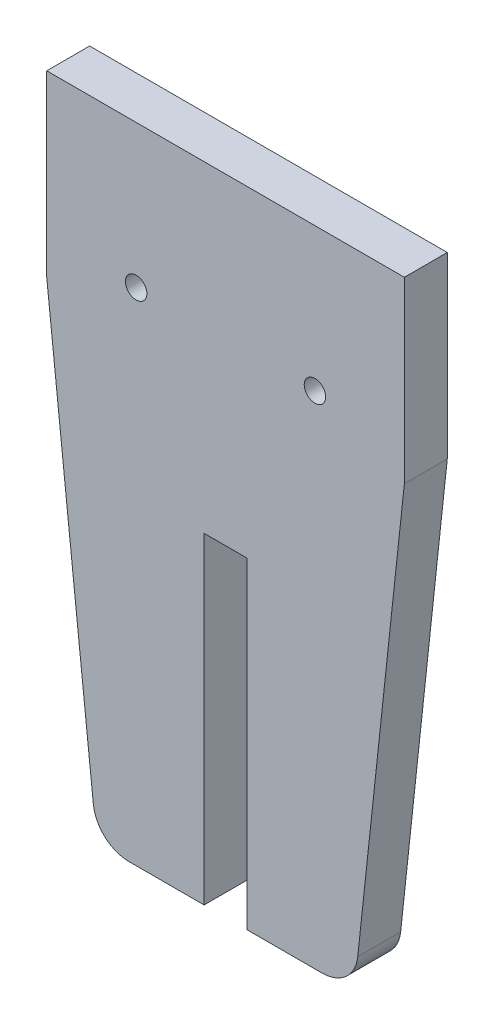
ISO-10303-21;
HEADER;
FILE_DESCRIPTION(('STEP AP214'),'2;1');
FILE_NAME('part.step','',(''),(''),'','','');
FILE_SCHEMA(('AUTOMOTIVE_DESIGN { 1 0 10303 214 1 1 1 1 }'));
ENDSEC;
DATA;
#1=APPLICATION_CONTEXT('core data for automotive mechanical design processes');
#2=APPLICATION_PROTOCOL_DEFINITION('international standard','automotive_design',2000,#1);
#3=PRODUCT_CONTEXT('',#1,'mechanical');
#4=PRODUCT('Part','Part','',(#3));
#5=PRODUCT_RELATED_PRODUCT_CATEGORY('part','',(#4));
#6=PRODUCT_DEFINITION_FORMATION('','',#4);
#7=PRODUCT_DEFINITION_CONTEXT('part definition',#1,'design');
#8=PRODUCT_DEFINITION('design','',#6,#7);
#9=PRODUCT_DEFINITION_SHAPE('','',#8);
#10=(LENGTH_UNIT() NAMED_UNIT(*) SI_UNIT(.MILLI.,.METRE.));
#11=(NAMED_UNIT(*) PLANE_ANGLE_UNIT() SI_UNIT($,.RADIAN.));
#12=(NAMED_UNIT(*) SI_UNIT($,.STERADIAN.) SOLID_ANGLE_UNIT());
#13=UNCERTAINTY_MEASURE_WITH_UNIT(LENGTH_MEASURE(1.E-05),#10,'distance_accuracy_value','');
#14=(GEOMETRIC_REPRESENTATION_CONTEXT(3) GLOBAL_UNCERTAINTY_ASSIGNED_CONTEXT((#13)) GLOBAL_UNIT_ASSIGNED_CONTEXT((#10,
#11,#12)) REPRESENTATION_CONTEXT('',''));
#15=CARTESIAN_POINT('',(0.,0.,0.));
#16=DIRECTION('',(0.,0.,1.));
#17=DIRECTION('',(1.,0.,0.));
#18=AXIS2_PLACEMENT_3D('',#15,#16,#17);
#19=CARTESIAN_POINT('',(18.,-90.,6.));
#20=DIRECTION('',(0.,1.,0.));
#21=DIRECTION('',(0.,0.,1.));
#22=AXIS2_PLACEMENT_3D('',#19,#20,#21);
#23=PLANE('',#22);
#24=DIRECTION('',(1.,0.,0.));
#25=VECTOR('',#24,1.);
#26=CARTESIAN_POINT('',(18.,-90.,0.));
#27=LINE('',#26,#25);
#28=CARTESIAN_POINT('',(3.,-90.,0.));
#29=VERTEX_POINT('',#28);
#30=CARTESIAN_POINT('',(13.5095510373289,-90.,0.));
#31=VERTEX_POINT('',#30);
#32=EDGE_CURVE('E148',#29,#31,#27,.T.);
#33=ORIENTED_EDGE('',*,*,#32,.T.);
#34=DIRECTION('',(0.,0.,-1.));
#35=VECTOR('',#34,1.);
#36=CARTESIAN_POINT('',(13.5095510373289,-90.,6.));
#37=LINE('',#36,#35);
#38=CARTESIAN_POINT('',(13.5095510373289,-90.,6.));
#39=VERTEX_POINT('',#38);
#40=EDGE_CURVE('E11',#31,#39,#37,.F.);
#41=ORIENTED_EDGE('',*,*,#40,.T.);
#42=DIRECTION('',(1.,0.,0.));
#43=VECTOR('',#42,1.);
#44=CARTESIAN_POINT('',(18.,-90.,6.));
#45=LINE('',#44,#43);
#46=CARTESIAN_POINT('',(3.,-90.,6.));
#47=VERTEX_POINT('',#46);
#48=EDGE_CURVE('E177',#47,#39,#45,.T.);
#49=ORIENTED_EDGE('',*,*,#48,.F.);
#50=DIRECTION('',(0.,0.,1.));
#51=VECTOR('',#50,1.);
#52=CARTESIAN_POINT('',(3.,-90.,0.));
#53=LINE('',#52,#51);
#54=EDGE_CURVE('E157',#29,#47,#53,.T.);
#55=ORIENTED_EDGE('',*,*,#54,.F.);
#56=EDGE_LOOP('',(#33,#41,#49,#55));
#57=FACE_BOUND('',#56,.T.);
#58=ADVANCED_FACE('F34',(#57),#23,.F.);
#59=CARTESIAN_POINT('',(-25.,0.,6.));
#60=DIRECTION('',(1.,0.,0.));
#61=DIRECTION('',(0.,1.,0.));
#62=AXIS2_PLACEMENT_3D('',#59,#60,#61);
#63=PLANE('',#62);
#64=DIRECTION('',(0.,-1.,0.));
#65=VECTOR('',#64,1.);
#66=CARTESIAN_POINT('',(-25.,0.,0.));
#67=LINE('',#66,#65);
#68=CARTESIAN_POINT('',(-25.,0.,0.));
#69=VERTEX_POINT('',#68);
#70=CARTESIAN_POINT('',(-25.,-25.,0.));
#71=VERTEX_POINT('',#70);
#72=EDGE_CURVE('E169',#69,#71,#67,.T.);
#73=ORIENTED_EDGE('',*,*,#72,.T.);
#74=DIRECTION('',(0.,0.,-1.));
#75=VECTOR('',#74,1.);
#76=CARTESIAN_POINT('',(-25.,-25.,6.));
#77=LINE('',#76,#75);
#78=CARTESIAN_POINT('',(-25.,-25.,6.));
#79=VERTEX_POINT('',#78);
#80=EDGE_CURVE('E207',#79,#71,#77,.T.);
#81=ORIENTED_EDGE('',*,*,#80,.F.);
#82=DIRECTION('',(0.,-1.,0.));
#83=VECTOR('',#82,1.);
#84=CARTESIAN_POINT('',(-25.,0.,6.));
#85=LINE('',#84,#83);
#86=CARTESIAN_POINT('',(-25.,0.,6.));
#87=VERTEX_POINT('',#86);
#88=EDGE_CURVE('E170',#87,#79,#85,.T.);
#89=ORIENTED_EDGE('',*,*,#88,.F.);
#90=DIRECTION('',(0.,0.,-1.));
#91=VECTOR('',#90,1.);
#92=CARTESIAN_POINT('',(-25.,0.,6.));
#93=LINE('',#92,#91);
#94=EDGE_CURVE('E186',#87,#69,#93,.T.);
#95=ORIENTED_EDGE('',*,*,#94,.T.);
#96=EDGE_LOOP('',(#73,#81,#89,#95));
#97=FACE_BOUND('',#96,.T.);
#98=ADVANCED_FACE('F245',(#97),#63,.F.);
#99=CARTESIAN_POINT('',(-25.,-25.,6.));
#100=DIRECTION('',(0.994251140256692,0.107073199719951,0.));
#101=DIRECTION('',(-0.107073199719951,0.994251140256692,0.));
#102=AXIS2_PLACEMENT_3D('',#99,#100,#101);
#103=PLANE('',#102);
#104=DIRECTION('',(0.107073199719951,-0.994251140256692,0.));
#105=VECTOR('',#104,1.);
#106=CARTESIAN_POINT('',(-25.,-25.,0.));
#107=LINE('',#106,#105);
#108=CARTESIAN_POINT('',(-18.4808067386123,-85.5353659985997,0.));
#109=VERTEX_POINT('',#108);
#110=EDGE_CURVE('E189',#71,#109,#107,.T.);
#111=ORIENTED_EDGE('',*,*,#110,.T.);
#112=DIRECTION('',(0.,0.,-1.));
#113=VECTOR('',#112,1.);
#114=CARTESIAN_POINT('',(-18.4808067386123,-85.5353659985997,6.));
#115=LINE('',#114,#113);
#116=CARTESIAN_POINT('',(-18.4808067386123,-85.5353659985997,6.));
#117=VERTEX_POINT('',#116);
#118=EDGE_CURVE('E217',#109,#117,#115,.F.);
#119=ORIENTED_EDGE('',*,*,#118,.T.);
#120=DIRECTION('',(0.107073199719951,-0.994251140256692,0.));
#121=VECTOR('',#120,1.);
#122=CARTESIAN_POINT('',(-25.,-25.,6.));
#123=LINE('',#122,#121);
#124=EDGE_CURVE('E173',#79,#117,#123,.T.);
#125=ORIENTED_EDGE('',*,*,#124,.F.);
#126=ORIENTED_EDGE('',*,*,#80,.T.);
#127=EDGE_LOOP('',(#111,#119,#125,#126));
#128=FACE_BOUND('',#127,.T.);
#129=ADVANCED_FACE('F247',(#128),#103,.F.);
#130=CARTESIAN_POINT('',(-13.5095510373289,-90.,6.));
#131=VERTEX_POINT('',#130);
#132=CARTESIAN_POINT('',(-3.,-90.,6.));
#133=VERTEX_POINT('',#132);
#134=EDGE_CURVE('E178',#131,#133,#45,.T.);
#135=ORIENTED_EDGE('',*,*,#134,.F.);
#136=DIRECTION('',(0.,0.,-1.));
#137=VECTOR('',#136,1.);
#138=CARTESIAN_POINT('',(-13.5095510373289,-90.,6.));
#139=LINE('',#138,#137);
#140=CARTESIAN_POINT('',(-13.5095510373289,-90.,0.));
#141=VERTEX_POINT('',#140);
#142=EDGE_CURVE('E210',#131,#141,#139,.T.);
#143=ORIENTED_EDGE('',*,*,#142,.T.);
#144=CARTESIAN_POINT('',(-3.,-90.,0.));
#145=VERTEX_POINT('',#144);
#146=EDGE_CURVE('E192',#141,#145,#27,.T.);
#147=ORIENTED_EDGE('',*,*,#146,.T.);
#148=DIRECTION('',(0.,0.,1.));
#149=VECTOR('',#148,1.);
#150=CARTESIAN_POINT('',(-3.,-90.,0.));
#151=LINE('',#150,#149);
#152=EDGE_CURVE('E160',#145,#133,#151,.T.);
#153=ORIENTED_EDGE('',*,*,#152,.T.);
#154=EDGE_LOOP('',(#135,#143,#147,#153));
#155=FACE_BOUND('',#154,.T.);
#156=ADVANCED_FACE('F255',(#155),#23,.F.);
#157=CARTESIAN_POINT('',(25.,-25.,6.));
#158=DIRECTION('',(-0.994251140256692,0.107073199719951,0.));
#159=DIRECTION('',(-0.107073199719951,-0.994251140256692,0.));
#160=AXIS2_PLACEMENT_3D('',#157,#158,#159);
#161=PLANE('',#160);
#162=DIRECTION('',(0.107073199719951,0.994251140256692,0.));
#163=VECTOR('',#162,1.);
#164=CARTESIAN_POINT('',(25.,-25.,6.));
#165=LINE('',#164,#163);
#166=CARTESIAN_POINT('',(18.4808067386123,-85.5353659985997,6.));
#167=VERTEX_POINT('',#166);
#168=CARTESIAN_POINT('',(25.,-25.,6.));
#169=VERTEX_POINT('',#168);
#170=EDGE_CURVE('E180',#167,#169,#165,.T.);
#171=ORIENTED_EDGE('',*,*,#170,.F.);
#172=DIRECTION('',(0.,0.,-1.));
#173=VECTOR('',#172,1.);
#174=CARTESIAN_POINT('',(18.4808067386123,-85.5353659985997,6.));
#175=LINE('',#174,#173);
#176=CARTESIAN_POINT('',(18.4808067386123,-85.5353659985997,0.));
#177=VERTEX_POINT('',#176);
#178=EDGE_CURVE('E43',#167,#177,#175,.T.);
#179=ORIENTED_EDGE('',*,*,#178,.T.);
#180=DIRECTION('',(0.107073199719951,0.994251140256692,0.));
#181=VECTOR('',#180,1.);
#182=CARTESIAN_POINT('',(25.,-25.,0.));
#183=LINE('',#182,#181);
#184=CARTESIAN_POINT('',(25.,-25.,0.));
#185=VERTEX_POINT('',#184);
#186=EDGE_CURVE('E194',#177,#185,#183,.T.);
#187=ORIENTED_EDGE('',*,*,#186,.T.);
#188=DIRECTION('',(0.,0.,-1.));
#189=VECTOR('',#188,1.);
#190=CARTESIAN_POINT('',(25.,-25.,6.));
#191=LINE('',#190,#189);
#192=EDGE_CURVE('E204',#169,#185,#191,.T.);
#193=ORIENTED_EDGE('',*,*,#192,.F.);
#194=EDGE_LOOP('',(#171,#179,#187,#193));
#195=FACE_BOUND('',#194,.T.);
#196=ADVANCED_FACE('F226',(#195),#161,.F.);
#197=CARTESIAN_POINT('',(25.,0.,6.));
#198=DIRECTION('',(-1.,0.,0.));
#199=DIRECTION('',(0.,-1.,0.));
#200=AXIS2_PLACEMENT_3D('',#197,#198,#199);
#201=PLANE('',#200);
#202=DIRECTION('',(0.,1.,0.));
#203=VECTOR('',#202,1.);
#204=CARTESIAN_POINT('',(25.,0.,0.));
#205=LINE('',#204,#203);
#206=CARTESIAN_POINT('',(25.,0.,0.));
#207=VERTEX_POINT('',#206);
#208=EDGE_CURVE('E196',#185,#207,#205,.T.);
#209=ORIENTED_EDGE('',*,*,#208,.T.);
#210=DIRECTION('',(0.,0.,-1.));
#211=VECTOR('',#210,1.);
#212=CARTESIAN_POINT('',(25.,0.,6.));
#213=LINE('',#212,#211);
#214=CARTESIAN_POINT('',(25.,0.,6.));
#215=VERTEX_POINT('',#214);
#216=EDGE_CURVE('E201',#215,#207,#213,.T.);
#217=ORIENTED_EDGE('',*,*,#216,.F.);
#218=DIRECTION('',(0.,1.,0.));
#219=VECTOR('',#218,1.);
#220=CARTESIAN_POINT('',(25.,0.,6.));
#221=LINE('',#220,#219);
#222=EDGE_CURVE('E182',#169,#215,#221,.T.);
#223=ORIENTED_EDGE('',*,*,#222,.F.);
#224=ORIENTED_EDGE('',*,*,#192,.T.);
#225=EDGE_LOOP('',(#209,#217,#223,#224));
#226=FACE_BOUND('',#225,.T.);
#227=ADVANCED_FACE('F234',(#226),#201,.F.);
#228=CARTESIAN_POINT('',(25.,0.,6.));
#229=DIRECTION('',(0.,-1.,0.));
#230=DIRECTION('',(0.,0.,-1.));
#231=AXIS2_PLACEMENT_3D('',#228,#229,#230);
#232=PLANE('',#231);
#233=DIRECTION('',(-1.,0.,0.));
#234=VECTOR('',#233,1.);
#235=CARTESIAN_POINT('',(25.,0.,0.));
#236=LINE('',#235,#234);
#237=EDGE_CURVE('E174',#207,#69,#236,.T.);
#238=ORIENTED_EDGE('',*,*,#237,.T.);
#239=ORIENTED_EDGE('',*,*,#94,.F.);
#240=DIRECTION('',(-1.,0.,0.));
#241=VECTOR('',#240,1.);
#242=CARTESIAN_POINT('',(25.,0.,6.));
#243=LINE('',#242,#241);
#244=EDGE_CURVE('E184',#215,#87,#243,.T.);
#245=ORIENTED_EDGE('',*,*,#244,.F.);
#246=ORIENTED_EDGE('',*,*,#216,.T.);
#247=EDGE_LOOP('',(#238,#239,#245,#246));
#248=FACE_BOUND('',#247,.T.);
#249=ADVANCED_FACE('F238',(#248),#232,.F.);
#250=CARTESIAN_POINT('',(0.,0.,6.));
#251=DIRECTION('',(0.,0.,-1.));
#252=DIRECTION('',(-1.,0.,0.));
#253=AXIS2_PLACEMENT_3D('',#250,#251,#252);
#254=PLANE('',#253);
#255=CARTESIAN_POINT('',(-12.5,-20.,6.));
#256=DIRECTION('',(0.,0.,1.));
#257=DIRECTION('',(1.,0.,0.));
#258=AXIS2_PLACEMENT_3D('',#255,#256,#257);
#259=CIRCLE('',#258,1.5);
#260=CARTESIAN_POINT('',(-11.,-20.,6.));
#261=VERTEX_POINT('',#260);
#262=EDGE_CURVE('E394',#261,#261,#259,.T.);
#263=ORIENTED_EDGE('',*,*,#262,.F.);
#264=EDGE_LOOP('',(#263));
#265=FACE_BOUND('',#264,.T.);
#266=CARTESIAN_POINT('',(12.5,-20.,6.));
#267=DIRECTION('',(0.,0.,-1.));
#268=DIRECTION('',(-1.,0.,0.));
#269=AXIS2_PLACEMENT_3D('',#266,#267,#268);
#270=CIRCLE('',#269,1.5);
#271=CARTESIAN_POINT('',(11.,-20.,6.));
#272=VERTEX_POINT('',#271);
#273=EDGE_CURVE('E152',#272,#272,#270,.T.);
#274=ORIENTED_EDGE('',*,*,#273,.T.);
#275=EDGE_LOOP('',(#274));
#276=FACE_BOUND('',#275,.T.);
#277=ORIENTED_EDGE('',*,*,#124,.T.);
#278=CARTESIAN_POINT('',(-13.5095510373289,-85.,6.));
#279=DIRECTION('',(0.,0.,-1.));
#280=DIRECTION('',(-1.,0.,0.));
#281=AXIS2_PLACEMENT_3D('',#278,#279,#280);
#282=CIRCLE('',#281,5.);
#283=EDGE_CURVE('E220',#117,#131,#282,.F.);
#284=ORIENTED_EDGE('',*,*,#283,.T.);
#285=ORIENTED_EDGE('',*,*,#134,.T.);
#286=DIRECTION('',(0.,1.,0.));
#287=VECTOR('',#286,1.);
#288=CARTESIAN_POINT('',(-3.,0.,6.));
#289=LINE('',#288,#287);
#290=CARTESIAN_POINT('',(-3.,-45.,6.));
#291=VERTEX_POINT('',#290);
#292=EDGE_CURVE('E165',#133,#291,#289,.T.);
#293=ORIENTED_EDGE('',*,*,#292,.T.);
#294=DIRECTION('',(1.,0.,0.));
#295=VECTOR('',#294,1.);
#296=CARTESIAN_POINT('',(0.,-45.,6.));
#297=LINE('',#296,#295);
#298=CARTESIAN_POINT('',(3.,-45.,6.));
#299=VERTEX_POINT('',#298);
#300=EDGE_CURVE('E159',#291,#299,#297,.T.);
#301=ORIENTED_EDGE('',*,*,#300,.T.);
#302=DIRECTION('',(0.,-1.,0.));
#303=VECTOR('',#302,1.);
#304=CARTESIAN_POINT('',(3.,0.,6.));
#305=LINE('',#304,#303);
#306=EDGE_CURVE('E131',#299,#47,#305,.T.);
#307=ORIENTED_EDGE('',*,*,#306,.T.);
#308=ORIENTED_EDGE('',*,*,#48,.T.);
#309=CARTESIAN_POINT('',(13.5095510373289,-85.,6.));
#310=DIRECTION('',(0.,0.,-1.));
#311=DIRECTION('',(-1.,0.,0.));
#312=AXIS2_PLACEMENT_3D('',#309,#310,#311);
#313=CIRCLE('',#312,5.);
#314=EDGE_CURVE('E51',#39,#167,#313,.F.);
#315=ORIENTED_EDGE('',*,*,#314,.T.);
#316=ORIENTED_EDGE('',*,*,#170,.T.);
#317=ORIENTED_EDGE('',*,*,#222,.T.);
#318=ORIENTED_EDGE('',*,*,#244,.T.);
#319=ORIENTED_EDGE('',*,*,#88,.T.);
#320=EDGE_LOOP('',(#277,#284,#285,#293,#301,#307,#308,#315,#316,#317,#318,#319));
#321=FACE_BOUND('',#320,.T.);
#322=ADVANCED_FACE('F241',(#265,#276,#321),#254,.F.);
#323=CARTESIAN_POINT('',(0.,0.,0.));
#324=DIRECTION('',(0.,0.,-1.));
#325=DIRECTION('',(-1.,0.,0.));
#326=AXIS2_PLACEMENT_3D('',#323,#324,#325);
#327=PLANE('',#326);
#328=CARTESIAN_POINT('',(-12.5,-20.,0.));
#329=DIRECTION('',(0.,0.,-1.));
#330=DIRECTION('',(-1.,0.,0.));
#331=AXIS2_PLACEMENT_3D('',#328,#329,#330);
#332=CIRCLE('',#331,1.5);
#333=CARTESIAN_POINT('',(-14.,-20.,0.));
#334=VERTEX_POINT('',#333);
#335=EDGE_CURVE('E38',#334,#334,#332,.F.);
#336=ORIENTED_EDGE('',*,*,#335,.T.);
#337=EDGE_LOOP('',(#336));
#338=FACE_BOUND('',#337,.T.);
#339=CARTESIAN_POINT('',(12.5,-20.,0.));
#340=DIRECTION('',(0.,0.,-1.));
#341=DIRECTION('',(-1.,0.,0.));
#342=AXIS2_PLACEMENT_3D('',#339,#340,#341);
#343=CIRCLE('',#342,1.5);
#344=CARTESIAN_POINT('',(11.,-20.,0.));
#345=VERTEX_POINT('',#344);
#346=EDGE_CURVE('E149',#345,#345,#343,.T.);
#347=ORIENTED_EDGE('',*,*,#346,.F.);
#348=EDGE_LOOP('',(#347));
#349=FACE_BOUND('',#348,.T.);
#350=ORIENTED_EDGE('',*,*,#146,.F.);
#351=CARTESIAN_POINT('',(-13.5095510373289,-85.,0.));
#352=DIRECTION('',(0.,0.,-1.));
#353=DIRECTION('',(-1.,0.,0.));
#354=AXIS2_PLACEMENT_3D('',#351,#352,#353);
#355=CIRCLE('',#354,5.);
#356=EDGE_CURVE('E215',#141,#109,#355,.T.);
#357=ORIENTED_EDGE('',*,*,#356,.T.);
#358=ORIENTED_EDGE('',*,*,#110,.F.);
#359=ORIENTED_EDGE('',*,*,#72,.F.);
#360=ORIENTED_EDGE('',*,*,#237,.F.);
#361=ORIENTED_EDGE('',*,*,#208,.F.);
#362=ORIENTED_EDGE('',*,*,#186,.F.);
#363=CARTESIAN_POINT('',(13.5095510373289,-85.,0.));
#364=DIRECTION('',(0.,0.,-1.));
#365=DIRECTION('',(-1.,0.,0.));
#366=AXIS2_PLACEMENT_3D('',#363,#364,#365);
#367=CIRCLE('',#366,5.);
#368=EDGE_CURVE('E213',#177,#31,#367,.T.);
#369=ORIENTED_EDGE('',*,*,#368,.T.);
#370=ORIENTED_EDGE('',*,*,#32,.F.);
#371=DIRECTION('',(0.,1.,0.));
#372=VECTOR('',#371,1.);
#373=CARTESIAN_POINT('',(3.,-45.,0.));
#374=LINE('',#373,#372);
#375=CARTESIAN_POINT('',(3.,-45.,0.));
#376=VERTEX_POINT('',#375);
#377=EDGE_CURVE('E128',#29,#376,#374,.T.);
#378=ORIENTED_EDGE('',*,*,#377,.T.);
#379=DIRECTION('',(-1.,0.,0.));
#380=VECTOR('',#379,1.);
#381=CARTESIAN_POINT('',(-3.,-45.,0.));
#382=LINE('',#381,#380);
#383=CARTESIAN_POINT('',(-3.,-45.,0.));
#384=VERTEX_POINT('',#383);
#385=EDGE_CURVE('E139',#376,#384,#382,.T.);
#386=ORIENTED_EDGE('',*,*,#385,.T.);
#387=DIRECTION('',(0.,-1.,0.));
#388=VECTOR('',#387,1.);
#389=CARTESIAN_POINT('',(-3.,-45.,0.));
#390=LINE('',#389,#388);
#391=EDGE_CURVE('E135',#384,#145,#390,.T.);
#392=ORIENTED_EDGE('',*,*,#391,.T.);
#393=EDGE_LOOP('',(#350,#357,#358,#359,#360,#361,#362,#369,#370,#378,#386,#392));
#394=FACE_BOUND('',#393,.T.);
#395=ADVANCED_FACE('F147',(#338,#349,#394),#327,.T.);
#396=CARTESIAN_POINT('',(3.,-45.,0.));
#397=DIRECTION('',(1.,0.,0.));
#398=DIRECTION('',(0.,1.,0.));
#399=AXIS2_PLACEMENT_3D('',#396,#397,#398);
#400=PLANE('',#399);
#401=DIRECTION('',(0.,0.,1.));
#402=VECTOR('',#401,1.);
#403=CARTESIAN_POINT('',(3.,-45.,0.));
#404=LINE('',#403,#402);
#405=EDGE_CURVE('E124',#376,#299,#404,.T.);
#406=ORIENTED_EDGE('',*,*,#405,.F.);
#407=ORIENTED_EDGE('',*,*,#377,.F.);
#408=ORIENTED_EDGE('',*,*,#54,.T.);
#409=ORIENTED_EDGE('',*,*,#306,.F.);
#410=EDGE_LOOP('',(#406,#407,#408,#409));
#411=FACE_BOUND('',#410,.T.);
#412=ADVANCED_FACE('F126',(#411),#400,.F.);
#413=CARTESIAN_POINT('',(-3.,-45.,0.));
#414=DIRECTION('',(-1.,0.,0.));
#415=DIRECTION('',(0.,-1.,0.));
#416=AXIS2_PLACEMENT_3D('',#413,#414,#415);
#417=PLANE('',#416);
#418=ORIENTED_EDGE('',*,*,#152,.F.);
#419=ORIENTED_EDGE('',*,*,#391,.F.);
#420=DIRECTION('',(0.,0.,1.));
#421=VECTOR('',#420,1.);
#422=CARTESIAN_POINT('',(-3.,-45.,0.));
#423=LINE('',#422,#421);
#424=EDGE_CURVE('E134',#384,#291,#423,.T.);
#425=ORIENTED_EDGE('',*,*,#424,.T.);
#426=ORIENTED_EDGE('',*,*,#292,.F.);
#427=EDGE_LOOP('',(#418,#419,#425,#426));
#428=FACE_BOUND('',#427,.T.);
#429=ADVANCED_FACE('F258',(#428),#417,.F.);
#430=CARTESIAN_POINT('',(-3.,-45.,0.));
#431=DIRECTION('',(0.,1.,0.));
#432=DIRECTION('',(0.,0.,1.));
#433=AXIS2_PLACEMENT_3D('',#430,#431,#432);
#434=PLANE('',#433);
#435=ORIENTED_EDGE('',*,*,#424,.F.);
#436=ORIENTED_EDGE('',*,*,#385,.F.);
#437=ORIENTED_EDGE('',*,*,#405,.T.);
#438=ORIENTED_EDGE('',*,*,#300,.F.);
#439=EDGE_LOOP('',(#435,#436,#437,#438));
#440=FACE_BOUND('',#439,.T.);
#441=ADVANCED_FACE('F140',(#440),#434,.F.);
#442=CARTESIAN_POINT('',(-13.5095510373289,-85.,6.));
#443=DIRECTION('',(0.,0.,-1.));
#444=DIRECTION('',(-1.,0.,0.));
#445=AXIS2_PLACEMENT_3D('',#442,#443,#444);
#446=CYLINDRICAL_SURFACE('',#445,5.);
#447=ORIENTED_EDGE('',*,*,#283,.F.);
#448=ORIENTED_EDGE('',*,*,#118,.F.);
#449=ORIENTED_EDGE('',*,*,#356,.F.);
#450=ORIENTED_EDGE('',*,*,#142,.F.);
#451=EDGE_LOOP('',(#447,#448,#449,#450));
#452=FACE_BOUND('',#451,.T.);
#453=ADVANCED_FACE('F250',(#452),#446,.T.);
#454=CARTESIAN_POINT('',(13.5095510373289,-85.,6.));
#455=DIRECTION('',(0.,0.,-1.));
#456=DIRECTION('',(-1.,0.,0.));
#457=AXIS2_PLACEMENT_3D('',#454,#455,#456);
#458=CYLINDRICAL_SURFACE('',#457,5.);
#459=ORIENTED_EDGE('',*,*,#314,.F.);
#460=ORIENTED_EDGE('',*,*,#40,.F.);
#461=ORIENTED_EDGE('',*,*,#368,.F.);
#462=ORIENTED_EDGE('',*,*,#178,.F.);
#463=EDGE_LOOP('',(#459,#460,#461,#462));
#464=FACE_BOUND('',#463,.T.);
#465=ADVANCED_FACE('F36',(#464),#458,.T.);
#466=CARTESIAN_POINT('',(12.5,-20.,6.));
#467=DIRECTION('',(0.,0.,-1.));
#468=DIRECTION('',(-1.,0.,0.));
#469=AXIS2_PLACEMENT_3D('',#466,#467,#468);
#470=CYLINDRICAL_SURFACE('',#469,1.5);
#471=ORIENTED_EDGE('',*,*,#346,.T.);
#472=EDGE_LOOP('',(#471));
#473=FACE_BOUND('',#472,.T.);
#474=ORIENTED_EDGE('',*,*,#273,.F.);
#475=EDGE_LOOP('',(#474));
#476=FACE_BOUND('',#475,.T.);
#477=ADVANCED_FACE('F260',(#473,#476),#470,.F.);
#478=CARTESIAN_POINT('',(-12.5,-20.,6.));
#479=DIRECTION('',(0.,0.,-1.));
#480=DIRECTION('',(-1.,0.,0.));
#481=AXIS2_PLACEMENT_3D('',#478,#479,#480);
#482=CYLINDRICAL_SURFACE('',#481,1.5);
#483=ORIENTED_EDGE('',*,*,#335,.F.);
#484=EDGE_LOOP('',(#483));
#485=FACE_BOUND('',#484,.T.);
#486=ORIENTED_EDGE('',*,*,#262,.T.);
#487=EDGE_LOOP('',(#486));
#488=FACE_BOUND('',#487,.T.);
#489=ADVANCED_FACE('F265',(#485,#488),#482,.F.);
#490=CLOSED_SHELL('',(#58,#98,#129,#156,#196,#227,#249,#322,#395,#412,#429,#441,#453,#465,#477,#489));
#491=MANIFOLD_SOLID_BREP('B2',#490);
#492=ADVANCED_BREP_SHAPE_REPRESENTATION('',(#18,#491),#14);
#493=SHAPE_DEFINITION_REPRESENTATION(#9,#492);
ENDSEC;
END-ISO-10303-21;
